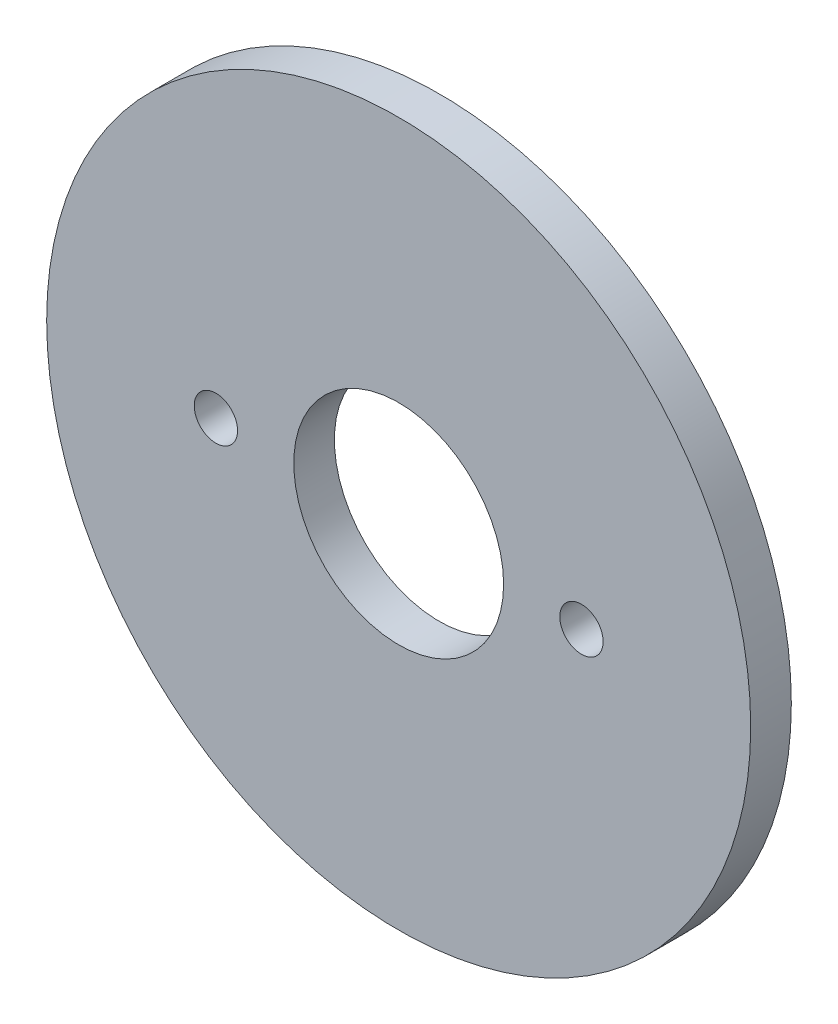
ISO-10303-21;
HEADER;
FILE_DESCRIPTION(('STEP AP214'),'2;1');
FILE_NAME('part.step','',(''),(''),'','','');
FILE_SCHEMA(('AUTOMOTIVE_DESIGN { 1 0 10303 214 1 1 1 1 }'));
ENDSEC;
DATA;
#1=APPLICATION_CONTEXT('core data for automotive mechanical design processes');
#2=APPLICATION_PROTOCOL_DEFINITION('international standard','automotive_design',2000,#1);
#3=PRODUCT_CONTEXT('',#1,'mechanical');
#4=PRODUCT('Part','Part','',(#3));
#5=PRODUCT_RELATED_PRODUCT_CATEGORY('part','',(#4));
#6=PRODUCT_DEFINITION_FORMATION('','',#4);
#7=PRODUCT_DEFINITION_CONTEXT('part definition',#1,'design');
#8=PRODUCT_DEFINITION('design','',#6,#7);
#9=PRODUCT_DEFINITION_SHAPE('','',#8);
#10=(LENGTH_UNIT() NAMED_UNIT(*) SI_UNIT(.MILLI.,.METRE.));
#11=(NAMED_UNIT(*) PLANE_ANGLE_UNIT() SI_UNIT($,.RADIAN.));
#12=(NAMED_UNIT(*) SI_UNIT($,.STERADIAN.) SOLID_ANGLE_UNIT());
#13=UNCERTAINTY_MEASURE_WITH_UNIT(LENGTH_MEASURE(1.E-05),#10,'distance_accuracy_value','');
#14=(GEOMETRIC_REPRESENTATION_CONTEXT(3) GLOBAL_UNCERTAINTY_ASSIGNED_CONTEXT((#13)) GLOBAL_UNIT_ASSIGNED_CONTEXT((#10,
#11,#12)) REPRESENTATION_CONTEXT('',''));
#15=CARTESIAN_POINT('',(0.,0.,0.));
#16=DIRECTION('',(0.,0.,1.));
#17=DIRECTION('',(1.,0.,0.));
#18=AXIS2_PLACEMENT_3D('',#15,#16,#17);
#19=CARTESIAN_POINT('',(0.,0.,1.5));
#20=DIRECTION('',(0.,0.,1.));
#21=DIRECTION('',(1.,0.,0.));
#22=AXIS2_PLACEMENT_3D('',#19,#20,#21);
#23=PLANE('',#22);
#24=CARTESIAN_POINT('',(-13.5,0.,1.5));
#25=DIRECTION('',(0.,0.,1.));
#26=DIRECTION('',(1.,0.,0.));
#27=AXIS2_PLACEMENT_3D('',#24,#25,#26);
#28=CIRCLE('',#27,1.6);
#29=CARTESIAN_POINT('',(-11.9,0.,1.5));
#30=VERTEX_POINT('',#29);
#31=EDGE_CURVE('E48',#30,#30,#28,.T.);
#32=ORIENTED_EDGE('',*,*,#31,.F.);
#33=EDGE_LOOP('',(#32));
#34=FACE_BOUND('',#33,.T.);
#35=CARTESIAN_POINT('',(0.,0.,1.5));
#36=DIRECTION('',(0.,0.,1.));
#37=DIRECTION('',(1.,0.,0.));
#38=AXIS2_PLACEMENT_3D('',#35,#36,#37);
#39=CIRCLE('',#38,26.);
#40=CARTESIAN_POINT('',(26.,0.,1.5));
#41=VERTEX_POINT('',#40);
#42=EDGE_CURVE('E10',#41,#41,#39,.T.);
#43=ORIENTED_EDGE('',*,*,#42,.T.);
#44=EDGE_LOOP('',(#43));
#45=FACE_BOUND('',#44,.T.);
#46=CARTESIAN_POINT('',(0.,0.,1.5));
#47=DIRECTION('',(0.,0.,1.));
#48=DIRECTION('',(1.,0.,0.));
#49=AXIS2_PLACEMENT_3D('',#46,#47,#48);
#50=CIRCLE('',#49,7.75);
#51=CARTESIAN_POINT('',(7.75,0.,1.5));
#52=VERTEX_POINT('',#51);
#53=EDGE_CURVE('E43',#52,#52,#50,.T.);
#54=ORIENTED_EDGE('',*,*,#53,.F.);
#55=EDGE_LOOP('',(#54));
#56=FACE_BOUND('',#55,.T.);
#57=CARTESIAN_POINT('',(13.5,0.,1.5));
#58=DIRECTION('',(0.,0.,1.));
#59=DIRECTION('',(1.,0.,0.));
#60=AXIS2_PLACEMENT_3D('',#57,#58,#59);
#61=CIRCLE('',#60,1.6);
#62=CARTESIAN_POINT('',(15.1,0.,1.5));
#63=VERTEX_POINT('',#62);
#64=EDGE_CURVE('E54',#63,#63,#61,.T.);
#65=ORIENTED_EDGE('',*,*,#64,.F.);
#66=EDGE_LOOP('',(#65));
#67=FACE_BOUND('',#66,.T.);
#68=ADVANCED_FACE('F32',(#34,#45,#56,#67),#23,.T.);
#69=CARTESIAN_POINT('',(0.,0.,-1.5));
#70=DIRECTION('',(0.,0.,1.));
#71=DIRECTION('',(1.,0.,0.));
#72=AXIS2_PLACEMENT_3D('',#69,#70,#71);
#73=PLANE('',#72);
#74=CARTESIAN_POINT('',(0.,0.,-1.5));
#75=DIRECTION('',(0.,0.,1.));
#76=DIRECTION('',(1.,0.,0.));
#77=AXIS2_PLACEMENT_3D('',#74,#75,#76);
#78=CIRCLE('',#77,26.);
#79=CARTESIAN_POINT('',(26.,0.,-1.5));
#80=VERTEX_POINT('',#79);
#81=EDGE_CURVE('E36',#80,#80,#78,.T.);
#82=ORIENTED_EDGE('',*,*,#81,.F.);
#83=EDGE_LOOP('',(#82));
#84=FACE_BOUND('',#83,.T.);
#85=CARTESIAN_POINT('',(0.,0.,-1.5));
#86=DIRECTION('',(0.,0.,1.));
#87=DIRECTION('',(1.,0.,0.));
#88=AXIS2_PLACEMENT_3D('',#85,#86,#87);
#89=CIRCLE('',#88,7.75);
#90=CARTESIAN_POINT('',(7.75,0.,-1.5));
#91=VERTEX_POINT('',#90);
#92=EDGE_CURVE('E45',#91,#91,#89,.T.);
#93=ORIENTED_EDGE('',*,*,#92,.T.);
#94=EDGE_LOOP('',(#93));
#95=FACE_BOUND('',#94,.T.);
#96=CARTESIAN_POINT('',(-13.5,0.,-1.5));
#97=DIRECTION('',(0.,0.,1.));
#98=DIRECTION('',(1.,0.,0.));
#99=AXIS2_PLACEMENT_3D('',#96,#97,#98);
#100=CIRCLE('',#99,1.6);
#101=CARTESIAN_POINT('',(-11.9,0.,-1.5));
#102=VERTEX_POINT('',#101);
#103=EDGE_CURVE('E51',#102,#102,#100,.T.);
#104=ORIENTED_EDGE('',*,*,#103,.T.);
#105=EDGE_LOOP('',(#104));
#106=FACE_BOUND('',#105,.T.);
#107=CARTESIAN_POINT('',(13.5,0.,-1.5));
#108=DIRECTION('',(0.,0.,1.));
#109=DIRECTION('',(1.,0.,0.));
#110=AXIS2_PLACEMENT_3D('',#107,#108,#109);
#111=CIRCLE('',#110,1.6);
#112=CARTESIAN_POINT('',(15.1,0.,-1.5));
#113=VERTEX_POINT('',#112);
#114=EDGE_CURVE('E57',#113,#113,#111,.T.);
#115=ORIENTED_EDGE('',*,*,#114,.T.);
#116=EDGE_LOOP('',(#115));
#117=FACE_BOUND('',#116,.T.);
#118=ADVANCED_FACE('F67',(#84,#95,#106,#117),#73,.F.);
#119=CARTESIAN_POINT('',(0.,0.,1.5));
#120=DIRECTION('',(0.,0.,-1.));
#121=DIRECTION('',(-1.,0.,0.));
#122=AXIS2_PLACEMENT_3D('',#119,#120,#121);
#123=CYLINDRICAL_SURFACE('',#122,26.);
#124=ORIENTED_EDGE('',*,*,#42,.F.);
#125=EDGE_LOOP('',(#124));
#126=FACE_BOUND('',#125,.T.);
#127=ORIENTED_EDGE('',*,*,#81,.T.);
#128=EDGE_LOOP('',(#127));
#129=FACE_BOUND('',#128,.T.);
#130=ADVANCED_FACE('F34',(#126,#129),#123,.T.);
#131=CARTESIAN_POINT('',(0.,0.,1.5));
#132=DIRECTION('',(0.,0.,-1.));
#133=DIRECTION('',(-1.,0.,0.));
#134=AXIS2_PLACEMENT_3D('',#131,#132,#133);
#135=CYLINDRICAL_SURFACE('',#134,7.75);
#136=ORIENTED_EDGE('',*,*,#53,.T.);
#137=EDGE_LOOP('',(#136));
#138=FACE_BOUND('',#137,.T.);
#139=ORIENTED_EDGE('',*,*,#92,.F.);
#140=EDGE_LOOP('',(#139));
#141=FACE_BOUND('',#140,.T.);
#142=ADVANCED_FACE('F76',(#138,#141),#135,.F.);
#143=CARTESIAN_POINT('',(-13.5,0.,1.5));
#144=DIRECTION('',(0.,0.,-1.));
#145=DIRECTION('',(-1.,0.,0.));
#146=AXIS2_PLACEMENT_3D('',#143,#144,#145);
#147=CYLINDRICAL_SURFACE('',#146,1.6);
#148=ORIENTED_EDGE('',*,*,#31,.T.);
#149=EDGE_LOOP('',(#148));
#150=FACE_BOUND('',#149,.T.);
#151=ORIENTED_EDGE('',*,*,#103,.F.);
#152=EDGE_LOOP('',(#151));
#153=FACE_BOUND('',#152,.T.);
#154=ADVANCED_FACE('F79',(#150,#153),#147,.F.);
#155=CARTESIAN_POINT('',(13.5,0.,1.5));
#156=DIRECTION('',(0.,0.,-1.));
#157=DIRECTION('',(-1.,0.,0.));
#158=AXIS2_PLACEMENT_3D('',#155,#156,#157);
#159=CYLINDRICAL_SURFACE('',#158,1.6);
#160=ORIENTED_EDGE('',*,*,#64,.T.);
#161=EDGE_LOOP('',(#160));
#162=FACE_BOUND('',#161,.T.);
#163=ORIENTED_EDGE('',*,*,#114,.F.);
#164=EDGE_LOOP('',(#163));
#165=FACE_BOUND('',#164,.T.);
#166=ADVANCED_FACE('F63',(#162,#165),#159,.F.);
#167=CLOSED_SHELL('',(#68,#118,#130,#142,#154,#166));
#168=MANIFOLD_SOLID_BREP('B2',#167);
#169=ADVANCED_BREP_SHAPE_REPRESENTATION('',(#18,#168),#14);
#170=SHAPE_DEFINITION_REPRESENTATION(#9,#169);
ENDSEC;
END-ISO-10303-21;
